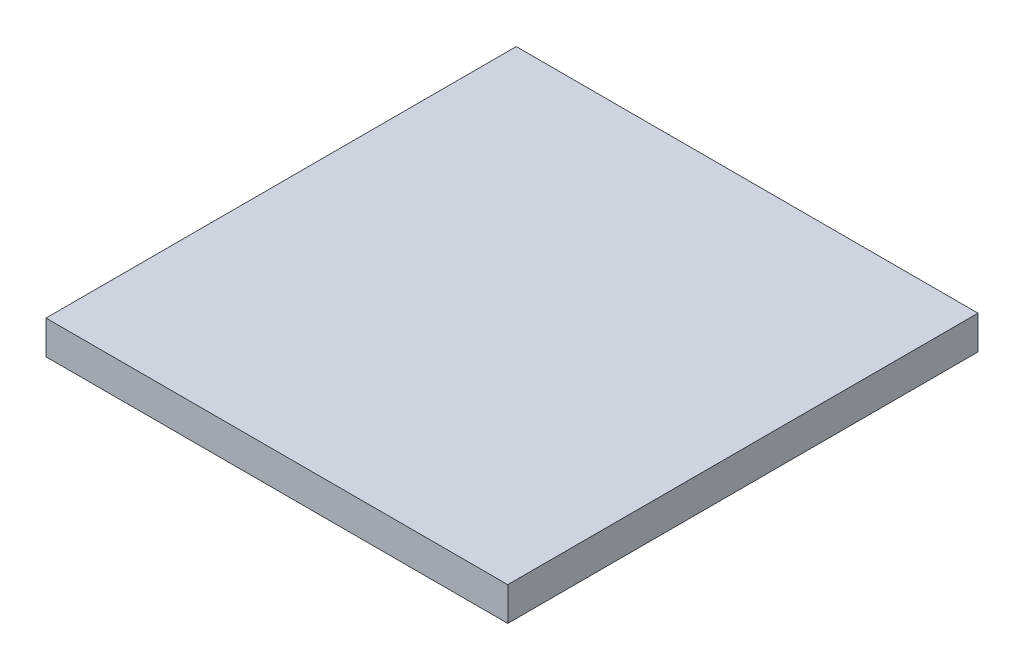
ISO-10303-21;
HEADER;
FILE_DESCRIPTION(('STEP AP214'),'2;1');
FILE_NAME('part.step','',(''),(''),'','','');
FILE_SCHEMA(('AUTOMOTIVE_DESIGN { 1 0 10303 214 1 1 1 1 }'));
ENDSEC;
DATA;
#1=APPLICATION_CONTEXT('core data for automotive mechanical design processes');
#2=APPLICATION_PROTOCOL_DEFINITION('international standard','automotive_design',2000,#1);
#3=PRODUCT_CONTEXT('',#1,'mechanical');
#4=PRODUCT('Part','Part','',(#3));
#5=PRODUCT_RELATED_PRODUCT_CATEGORY('part','',(#4));
#6=PRODUCT_DEFINITION_FORMATION('','',#4);
#7=PRODUCT_DEFINITION_CONTEXT('part definition',#1,'design');
#8=PRODUCT_DEFINITION('design','',#6,#7);
#9=PRODUCT_DEFINITION_SHAPE('','',#8);
#10=(LENGTH_UNIT() NAMED_UNIT(*) SI_UNIT(.MILLI.,.METRE.));
#11=(NAMED_UNIT(*) PLANE_ANGLE_UNIT() SI_UNIT($,.RADIAN.));
#12=(NAMED_UNIT(*) SI_UNIT($,.STERADIAN.) SOLID_ANGLE_UNIT());
#13=UNCERTAINTY_MEASURE_WITH_UNIT(LENGTH_MEASURE(1.E-05),#10,'distance_accuracy_value','');
#14=(GEOMETRIC_REPRESENTATION_CONTEXT(3) GLOBAL_UNCERTAINTY_ASSIGNED_CONTEXT((#13)) GLOBAL_UNIT_ASSIGNED_CONTEXT((#10,
#11,#12)) REPRESENTATION_CONTEXT('',''));
#15=CARTESIAN_POINT('',(0.,0.,0.));
#16=DIRECTION('',(0.,0.,1.));
#17=DIRECTION('',(1.,0.,0.));
#18=AXIS2_PLACEMENT_3D('',#15,#16,#17);
#19=CARTESIAN_POINT('',(43.65,203.61,-127.004202423773));
#20=DIRECTION('',(1.,0.,0.));
#21=DIRECTION('',(0.,0.,1.));
#22=AXIS2_PLACEMENT_3D('',#19,#20,#21);
#23=PLANE('',#22);
#24=DIRECTION('',(0.,1.,0.));
#25=VECTOR('',#24,1.);
#26=CARTESIAN_POINT('',(43.65,0.,-38.1042024237734));
#27=LINE('',#26,#25);
#28=CARTESIAN_POINT('',(43.65,95.6500000000001,-38.1042024237734));
#29=VERTEX_POINT('',#28);
#30=CARTESIAN_POINT('',(43.65,102.,-38.1042024237734));
#31=VERTEX_POINT('',#30);
#32=EDGE_CURVE('E81',#29,#31,#27,.T.);
#33=ORIENTED_EDGE('',*,*,#32,.F.);
#34=DIRECTION('',(0.,0.,1.));
#35=VECTOR('',#34,1.);
#36=CARTESIAN_POINT('',(43.65,95.65,0.));
#37=LINE('',#36,#35);
#38=CARTESIAN_POINT('',(43.65,95.6500000000001,-127.004202423773));
#39=VERTEX_POINT('',#38);
#40=EDGE_CURVE('E42',#39,#29,#37,.T.);
#41=ORIENTED_EDGE('',*,*,#40,.F.);
#42=DIRECTION('',(0.,-1.,0.));
#43=VECTOR('',#42,1.);
#44=CARTESIAN_POINT('',(43.65,0.,-127.004202423773));
#45=LINE('',#44,#43);
#46=CARTESIAN_POINT('',(43.65,102.,-127.004202423773));
#47=VERTEX_POINT('',#46);
#48=EDGE_CURVE('E11',#47,#39,#45,.T.);
#49=ORIENTED_EDGE('',*,*,#48,.F.);
#50=DIRECTION('',(0.,0.,-1.));
#51=VECTOR('',#50,1.);
#52=CARTESIAN_POINT('',(43.65,102.,-38.1042024237733));
#53=LINE('',#52,#51);
#54=EDGE_CURVE('E37',#31,#47,#53,.T.);
#55=ORIENTED_EDGE('',*,*,#54,.F.);
#56=EDGE_LOOP('',(#33,#41,#49,#55));
#57=FACE_BOUND('',#56,.T.);
#58=ADVANCED_FACE('F34',(#57),#23,.T.);
#59=CARTESIAN_POINT('',(-43.65,203.61,-127.004202423773));
#60=DIRECTION('',(-1.,0.,0.));
#61=DIRECTION('',(0.,0.,-1.));
#62=AXIS2_PLACEMENT_3D('',#59,#60,#61);
#63=PLANE('',#62);
#64=DIRECTION('',(0.,-1.,0.));
#65=VECTOR('',#64,1.);
#66=CARTESIAN_POINT('',(-43.65,0.,-127.004202423773));
#67=LINE('',#66,#65);
#68=CARTESIAN_POINT('',(-43.65,102.,-127.004202423773));
#69=VERTEX_POINT('',#68);
#70=CARTESIAN_POINT('',(-43.65,95.6500000000001,-127.004202423773));
#71=VERTEX_POINT('',#70);
#72=EDGE_CURVE('E95',#69,#71,#67,.T.);
#73=ORIENTED_EDGE('',*,*,#72,.T.);
#74=DIRECTION('',(0.,0.,1.));
#75=VECTOR('',#74,1.);
#76=CARTESIAN_POINT('',(-43.65,95.65,0.));
#77=LINE('',#76,#75);
#78=CARTESIAN_POINT('',(-43.65,95.6500000000001,-38.1042024237734));
#79=VERTEX_POINT('',#78);
#80=EDGE_CURVE('E90',#71,#79,#77,.T.);
#81=ORIENTED_EDGE('',*,*,#80,.T.);
#82=DIRECTION('',(0.,1.,0.));
#83=VECTOR('',#82,1.);
#84=CARTESIAN_POINT('',(-43.65,0.,-38.1042024237734));
#85=LINE('',#84,#83);
#86=CARTESIAN_POINT('',(-43.65,102.,-38.1042024237734));
#87=VERTEX_POINT('',#86);
#88=EDGE_CURVE('E78',#79,#87,#85,.T.);
#89=ORIENTED_EDGE('',*,*,#88,.T.);
#90=DIRECTION('',(0.,0.,1.));
#91=VECTOR('',#90,1.);
#92=CARTESIAN_POINT('',(-43.65,102.,-38.1042024237733));
#93=LINE('',#92,#91);
#94=EDGE_CURVE('E84',#69,#87,#93,.T.);
#95=ORIENTED_EDGE('',*,*,#94,.F.);
#96=EDGE_LOOP('',(#73,#81,#89,#95));
#97=FACE_BOUND('',#96,.T.);
#98=ADVANCED_FACE('F88',(#97),#63,.T.);
#99=CARTESIAN_POINT('',(-50.,203.6,-38.1042024237733));
#100=DIRECTION('',(0.,0.,1.));
#101=DIRECTION('',(0.,-1.,0.));
#102=AXIS2_PLACEMENT_3D('',#99,#100,#101);
#103=PLANE('',#102);
#104=DIRECTION('',(-1.,0.,0.));
#105=VECTOR('',#104,1.);
#106=CARTESIAN_POINT('',(-50.,102.,-38.1042024237734));
#107=LINE('',#106,#105);
#108=EDGE_CURVE('E56',#31,#87,#107,.T.);
#109=ORIENTED_EDGE('',*,*,#108,.T.);
#110=ORIENTED_EDGE('',*,*,#88,.F.);
#111=DIRECTION('',(1.,0.,0.));
#112=VECTOR('',#111,1.);
#113=CARTESIAN_POINT('',(-50.,95.6500000000001,-38.1042024237734));
#114=LINE('',#113,#112);
#115=EDGE_CURVE('E91',#79,#29,#114,.T.);
#116=ORIENTED_EDGE('',*,*,#115,.T.);
#117=ORIENTED_EDGE('',*,*,#32,.T.);
#118=EDGE_LOOP('',(#109,#110,#116,#117));
#119=FACE_BOUND('',#118,.T.);
#120=ADVANCED_FACE('F76',(#119),#103,.T.);
#121=CARTESIAN_POINT('',(-50.,102.,-127.004202423773));
#122=DIRECTION('',(0.,0.,-1.));
#123=DIRECTION('',(1.,0.,0.));
#124=AXIS2_PLACEMENT_3D('',#121,#122,#123);
#125=PLANE('',#124);
#126=ORIENTED_EDGE('',*,*,#48,.T.);
#127=DIRECTION('',(1.,0.,0.));
#128=VECTOR('',#127,1.);
#129=CARTESIAN_POINT('',(-50.,95.6500000000001,-127.004202423773));
#130=LINE('',#129,#128);
#131=EDGE_CURVE('E93',#71,#39,#130,.T.);
#132=ORIENTED_EDGE('',*,*,#131,.F.);
#133=ORIENTED_EDGE('',*,*,#72,.F.);
#134=DIRECTION('',(-1.,0.,0.));
#135=VECTOR('',#134,1.);
#136=CARTESIAN_POINT('',(50.01,102.,-127.004202423773));
#137=LINE('',#136,#135);
#138=EDGE_CURVE('E49',#47,#69,#137,.T.);
#139=ORIENTED_EDGE('',*,*,#138,.F.);
#140=EDGE_LOOP('',(#126,#132,#133,#139));
#141=FACE_BOUND('',#140,.T.);
#142=ADVANCED_FACE('F108',(#141),#125,.T.);
#143=CARTESIAN_POINT('',(-50.,95.6500000000001,-44.4542024237734));
#144=DIRECTION('',(0.,-1.,0.));
#145=DIRECTION('',(0.,0.,-1.));
#146=AXIS2_PLACEMENT_3D('',#143,#144,#145);
#147=PLANE('',#146);
#148=ORIENTED_EDGE('',*,*,#40,.T.);
#149=ORIENTED_EDGE('',*,*,#115,.F.);
#150=ORIENTED_EDGE('',*,*,#80,.F.);
#151=ORIENTED_EDGE('',*,*,#131,.T.);
#152=EDGE_LOOP('',(#148,#149,#150,#151));
#153=FACE_BOUND('',#152,.T.);
#154=ADVANCED_FACE('F105',(#153),#147,.T.);
#155=CARTESIAN_POINT('',(50.01,102.,-38.1042024237733));
#156=DIRECTION('',(0.,-1.,0.));
#157=DIRECTION('',(0.,0.,-1.));
#158=AXIS2_PLACEMENT_3D('',#155,#156,#157);
#159=PLANE('',#158);
#160=ORIENTED_EDGE('',*,*,#54,.T.);
#161=ORIENTED_EDGE('',*,*,#138,.T.);
#162=ORIENTED_EDGE('',*,*,#94,.T.);
#163=ORIENTED_EDGE('',*,*,#108,.F.);
#164=EDGE_LOOP('',(#160,#161,#162,#163));
#165=FACE_BOUND('',#164,.T.);
#166=ADVANCED_FACE('F85',(#165),#159,.F.);
#167=CLOSED_SHELL('',(#58,#98,#120,#142,#154,#166));
#168=MANIFOLD_SOLID_BREP('B2',#167);
#169=ADVANCED_BREP_SHAPE_REPRESENTATION('',(#18,#168),#14);
#170=SHAPE_DEFINITION_REPRESENTATION(#9,#169);
ENDSEC;
END-ISO-10303-21;
